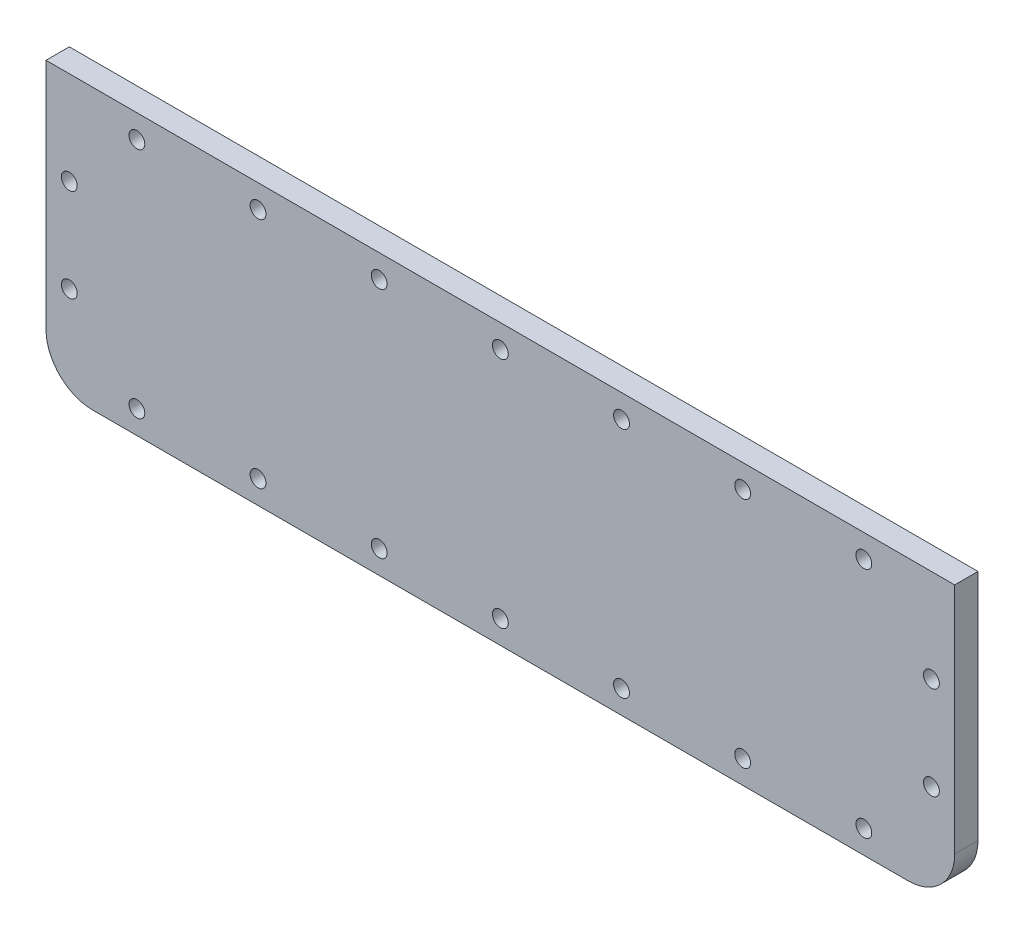
ISO-10303-21;
HEADER;
FILE_DESCRIPTION(('STEP AP214'),'2;1');
FILE_NAME('part.step','',(''),(''),'','','');
FILE_SCHEMA(('AUTOMOTIVE_DESIGN { 1 0 10303 214 1 1 1 1 }'));
ENDSEC;
DATA;
#1=APPLICATION_CONTEXT('core data for automotive mechanical design processes');
#2=APPLICATION_PROTOCOL_DEFINITION('international standard','automotive_design',2000,#1);
#3=PRODUCT_CONTEXT('',#1,'mechanical');
#4=PRODUCT('Part','Part','',(#3));
#5=PRODUCT_RELATED_PRODUCT_CATEGORY('part','',(#4));
#6=PRODUCT_DEFINITION_FORMATION('','',#4);
#7=PRODUCT_DEFINITION_CONTEXT('part definition',#1,'design');
#8=PRODUCT_DEFINITION('design','',#6,#7);
#9=PRODUCT_DEFINITION_SHAPE('','',#8);
#10=(LENGTH_UNIT() NAMED_UNIT(*) SI_UNIT(.MILLI.,.METRE.));
#11=(NAMED_UNIT(*) PLANE_ANGLE_UNIT() SI_UNIT($,.RADIAN.));
#12=(NAMED_UNIT(*) SI_UNIT($,.STERADIAN.) SOLID_ANGLE_UNIT());
#13=UNCERTAINTY_MEASURE_WITH_UNIT(LENGTH_MEASURE(1.E-05),#10,'distance_accuracy_value','');
#14=(GEOMETRIC_REPRESENTATION_CONTEXT(3) GLOBAL_UNCERTAINTY_ASSIGNED_CONTEXT((#13)) GLOBAL_UNIT_ASSIGNED_CONTEXT((#10,
#11,#12)) REPRESENTATION_CONTEXT('',''));
#15=CARTESIAN_POINT('',(0.,0.,0.));
#16=DIRECTION('',(0.,0.,1.));
#17=DIRECTION('',(1.,0.,0.));
#18=AXIS2_PLACEMENT_3D('',#15,#16,#17);
#19=CARTESIAN_POINT('',(0.,0.,6.35));
#20=DIRECTION('',(0.,0.,1.));
#21=DIRECTION('',(1.,0.,0.));
#22=AXIS2_PLACEMENT_3D('',#19,#20,#21);
#23=PLANE('',#22);
#24=CARTESIAN_POINT('',(-66.04,31.75,6.35));
#25=DIRECTION('',(0.,0.,1.));
#26=DIRECTION('',(1.,0.,0.));
#27=AXIS2_PLACEMENT_3D('',#24,#25,#26);
#28=CIRCLE('',#27,2.15899999999999);
#29=CARTESIAN_POINT('',(-63.881,31.75,6.35));
#30=VERTEX_POINT('',#29);
#31=EDGE_CURVE('E239',#30,#30,#28,.T.);
#32=ORIENTED_EDGE('',*,*,#31,.F.);
#33=EDGE_LOOP('',(#32));
#34=FACE_BOUND('',#33,.T.);
#35=CARTESIAN_POINT('',(0.,31.75,6.35));
#36=DIRECTION('',(0.,0.,1.));
#37=DIRECTION('',(1.,0.,0.));
#38=AXIS2_PLACEMENT_3D('',#35,#36,#37);
#39=CIRCLE('',#38,2.159);
#40=CARTESIAN_POINT('',(2.15900000000004,31.75,6.35));
#41=VERTEX_POINT('',#40);
#42=EDGE_CURVE('E227',#41,#41,#39,.T.);
#43=ORIENTED_EDGE('',*,*,#42,.F.);
#44=EDGE_LOOP('',(#43));
#45=FACE_BOUND('',#44,.T.);
#46=CARTESIAN_POINT('',(66.04,31.75,6.35));
#47=DIRECTION('',(0.,0.,1.));
#48=DIRECTION('',(1.,0.,0.));
#49=AXIS2_PLACEMENT_3D('',#46,#47,#48);
#50=CIRCLE('',#49,2.15899999999999);
#51=CARTESIAN_POINT('',(68.199,31.75,6.35));
#52=VERTEX_POINT('',#51);
#53=EDGE_CURVE('E215',#52,#52,#50,.T.);
#54=ORIENTED_EDGE('',*,*,#53,.F.);
#55=EDGE_LOOP('',(#54));
#56=FACE_BOUND('',#55,.T.);
#57=CARTESIAN_POINT('',(117.475,12.7,6.35));
#58=DIRECTION('',(0.,0.,1.));
#59=DIRECTION('',(1.,0.,0.));
#60=AXIS2_PLACEMENT_3D('',#57,#58,#59);
#61=CIRCLE('',#60,2.15900000000002);
#62=CARTESIAN_POINT('',(119.634,12.7,6.35));
#63=VERTEX_POINT('',#62);
#64=EDGE_CURVE('E203',#63,#63,#61,.T.);
#65=ORIENTED_EDGE('',*,*,#64,.F.);
#66=EDGE_LOOP('',(#65));
#67=FACE_BOUND('',#66,.T.);
#68=CARTESIAN_POINT('',(99.06,-31.75,6.35));
#69=DIRECTION('',(0.,0.,1.));
#70=DIRECTION('',(1.,0.,0.));
#71=AXIS2_PLACEMENT_3D('',#68,#69,#70);
#72=CIRCLE('',#71,2.15899999999999);
#73=CARTESIAN_POINT('',(101.219,-31.75,6.35));
#74=VERTEX_POINT('',#73);
#75=EDGE_CURVE('E191',#74,#74,#72,.T.);
#76=ORIENTED_EDGE('',*,*,#75,.F.);
#77=EDGE_LOOP('',(#76));
#78=FACE_BOUND('',#77,.T.);
#79=CARTESIAN_POINT('',(33.02,-31.75,6.35));
#80=DIRECTION('',(0.,0.,1.));
#81=DIRECTION('',(1.,0.,0.));
#82=AXIS2_PLACEMENT_3D('',#79,#80,#81);
#83=CIRCLE('',#82,2.159);
#84=CARTESIAN_POINT('',(35.179,-31.75,6.35));
#85=VERTEX_POINT('',#84);
#86=EDGE_CURVE('E179',#85,#85,#83,.T.);
#87=ORIENTED_EDGE('',*,*,#86,.F.);
#88=EDGE_LOOP('',(#87));
#89=FACE_BOUND('',#88,.T.);
#90=CARTESIAN_POINT('',(-33.02,-31.75,6.35));
#91=DIRECTION('',(0.,0.,1.));
#92=DIRECTION('',(1.,0.,0.));
#93=AXIS2_PLACEMENT_3D('',#90,#91,#92);
#94=CIRCLE('',#93,2.159);
#95=CARTESIAN_POINT('',(-30.861,-31.75,6.35));
#96=VERTEX_POINT('',#95);
#97=EDGE_CURVE('E167',#96,#96,#94,.T.);
#98=ORIENTED_EDGE('',*,*,#97,.F.);
#99=EDGE_LOOP('',(#98));
#100=FACE_BOUND('',#99,.T.);
#101=CARTESIAN_POINT('',(-99.06,-31.75,6.35));
#102=DIRECTION('',(0.,0.,1.));
#103=DIRECTION('',(1.,0.,0.));
#104=AXIS2_PLACEMENT_3D('',#101,#102,#103);
#105=CIRCLE('',#104,2.15899999999999);
#106=CARTESIAN_POINT('',(-96.901,-31.75,6.35));
#107=VERTEX_POINT('',#106);
#108=EDGE_CURVE('E155',#107,#107,#105,.T.);
#109=ORIENTED_EDGE('',*,*,#108,.F.);
#110=EDGE_LOOP('',(#109));
#111=FACE_BOUND('',#110,.T.);
#112=CARTESIAN_POINT('',(-117.475,12.7,6.35));
#113=DIRECTION('',(0.,0.,1.));
#114=DIRECTION('',(1.,0.,0.));
#115=AXIS2_PLACEMENT_3D('',#112,#113,#114);
#116=CIRCLE('',#115,2.15899999999999);
#117=CARTESIAN_POINT('',(-115.316,12.7,6.35));
#118=VERTEX_POINT('',#117);
#119=EDGE_CURVE('E143',#118,#118,#116,.T.);
#120=ORIENTED_EDGE('',*,*,#119,.F.);
#121=EDGE_LOOP('',(#120));
#122=FACE_BOUND('',#121,.T.);
#123=DIRECTION('',(1.,0.,0.));
#124=VECTOR('',#123,1.);
#125=CARTESIAN_POINT('',(-123.825,-38.1,6.35));
#126=LINE('',#125,#124);
#127=CARTESIAN_POINT('',(-111.125,-38.1,6.35));
#128=VERTEX_POINT('',#127);
#129=CARTESIAN_POINT('',(111.125,-38.1,6.35));
#130=VERTEX_POINT('',#129);
#131=EDGE_CURVE('E115',#128,#130,#126,.T.);
#132=ORIENTED_EDGE('',*,*,#131,.T.);
#133=CARTESIAN_POINT('',(111.125,-25.4,6.35));
#134=DIRECTION('',(0.,0.,1.));
#135=DIRECTION('',(1.,0.,0.));
#136=AXIS2_PLACEMENT_3D('',#133,#134,#135);
#137=CIRCLE('',#136,12.7);
#138=CARTESIAN_POINT('',(123.825,-25.4,6.35));
#139=VERTEX_POINT('',#138);
#140=EDGE_CURVE('E41',#130,#139,#137,.T.);
#141=ORIENTED_EDGE('',*,*,#140,.T.);
#142=DIRECTION('',(0.,1.,0.));
#143=VECTOR('',#142,1.);
#144=CARTESIAN_POINT('',(123.825,38.1,6.35));
#145=LINE('',#144,#143);
#146=CARTESIAN_POINT('',(123.825,38.1,6.35));
#147=VERTEX_POINT('',#146);
#148=EDGE_CURVE('E87',#139,#147,#145,.T.);
#149=ORIENTED_EDGE('',*,*,#148,.T.);
#150=DIRECTION('',(-1.,0.,0.));
#151=VECTOR('',#150,1.);
#152=CARTESIAN_POINT('',(-123.825,38.1,6.35));
#153=LINE('',#152,#151);
#154=CARTESIAN_POINT('',(-123.825,38.1,6.35));
#155=VERTEX_POINT('',#154);
#156=EDGE_CURVE('E90',#147,#155,#153,.T.);
#157=ORIENTED_EDGE('',*,*,#156,.T.);
#158=DIRECTION('',(0.,-1.,0.));
#159=VECTOR('',#158,1.);
#160=CARTESIAN_POINT('',(-123.825,38.1,6.35));
#161=LINE('',#160,#159);
#162=CARTESIAN_POINT('',(-123.825,-25.4,6.35));
#163=VERTEX_POINT('',#162);
#164=EDGE_CURVE('E105',#155,#163,#161,.T.);
#165=ORIENTED_EDGE('',*,*,#164,.T.);
#166=CARTESIAN_POINT('',(-111.125,-25.4,6.35));
#167=DIRECTION('',(0.,0.,1.));
#168=DIRECTION('',(1.,0.,0.));
#169=AXIS2_PLACEMENT_3D('',#166,#167,#168);
#170=CIRCLE('',#169,12.7);
#171=EDGE_CURVE('E126',#163,#128,#170,.T.);
#172=ORIENTED_EDGE('',*,*,#171,.T.);
#173=EDGE_LOOP('',(#132,#141,#149,#157,#165,#172));
#174=FACE_BOUND('',#173,.T.);
#175=CARTESIAN_POINT('',(-117.475,-12.7,6.35));
#176=DIRECTION('',(0.,0.,1.));
#177=DIRECTION('',(1.,0.,0.));
#178=AXIS2_PLACEMENT_3D('',#175,#176,#177);
#179=CIRCLE('',#178,2.15899999999999);
#180=CARTESIAN_POINT('',(-115.316,-12.7,6.35));
#181=VERTEX_POINT('',#180);
#182=EDGE_CURVE('E149',#181,#181,#179,.T.);
#183=ORIENTED_EDGE('',*,*,#182,.F.);
#184=EDGE_LOOP('',(#183));
#185=FACE_BOUND('',#184,.T.);
#186=CARTESIAN_POINT('',(-66.04,-31.75,6.35));
#187=DIRECTION('',(0.,0.,1.));
#188=DIRECTION('',(1.,0.,0.));
#189=AXIS2_PLACEMENT_3D('',#186,#187,#188);
#190=CIRCLE('',#189,2.15899999999999);
#191=CARTESIAN_POINT('',(-63.881,-31.75,6.35));
#192=VERTEX_POINT('',#191);
#193=EDGE_CURVE('E161',#192,#192,#190,.T.);
#194=ORIENTED_EDGE('',*,*,#193,.F.);
#195=EDGE_LOOP('',(#194));
#196=FACE_BOUND('',#195,.T.);
#197=CARTESIAN_POINT('',(0.,-31.75,6.35));
#198=DIRECTION('',(0.,0.,1.));
#199=DIRECTION('',(1.,0.,0.));
#200=AXIS2_PLACEMENT_3D('',#197,#198,#199);
#201=CIRCLE('',#200,2.159);
#202=CARTESIAN_POINT('',(2.15900000000003,-31.75,6.35));
#203=VERTEX_POINT('',#202);
#204=EDGE_CURVE('E173',#203,#203,#201,.T.);
#205=ORIENTED_EDGE('',*,*,#204,.F.);
#206=EDGE_LOOP('',(#205));
#207=FACE_BOUND('',#206,.T.);
#208=CARTESIAN_POINT('',(66.04,-31.75,6.35));
#209=DIRECTION('',(0.,0.,1.));
#210=DIRECTION('',(1.,0.,0.));
#211=AXIS2_PLACEMENT_3D('',#208,#209,#210);
#212=CIRCLE('',#211,2.15899999999999);
#213=CARTESIAN_POINT('',(68.199,-31.75,6.35));
#214=VERTEX_POINT('',#213);
#215=EDGE_CURVE('E185',#214,#214,#212,.T.);
#216=ORIENTED_EDGE('',*,*,#215,.F.);
#217=EDGE_LOOP('',(#216));
#218=FACE_BOUND('',#217,.T.);
#219=CARTESIAN_POINT('',(117.475,-12.7,6.35));
#220=DIRECTION('',(0.,0.,1.));
#221=DIRECTION('',(1.,0.,0.));
#222=AXIS2_PLACEMENT_3D('',#219,#220,#221);
#223=CIRCLE('',#222,2.15899999999999);
#224=CARTESIAN_POINT('',(119.634,-12.7,6.35));
#225=VERTEX_POINT('',#224);
#226=EDGE_CURVE('E197',#225,#225,#223,.T.);
#227=ORIENTED_EDGE('',*,*,#226,.F.);
#228=EDGE_LOOP('',(#227));
#229=FACE_BOUND('',#228,.T.);
#230=CARTESIAN_POINT('',(99.06,31.75,6.35));
#231=DIRECTION('',(0.,0.,1.));
#232=DIRECTION('',(1.,0.,0.));
#233=AXIS2_PLACEMENT_3D('',#230,#231,#232);
#234=CIRCLE('',#233,2.15899999999999);
#235=CARTESIAN_POINT('',(101.219,31.75,6.35));
#236=VERTEX_POINT('',#235);
#237=EDGE_CURVE('E209',#236,#236,#234,.T.);
#238=ORIENTED_EDGE('',*,*,#237,.F.);
#239=EDGE_LOOP('',(#238));
#240=FACE_BOUND('',#239,.T.);
#241=CARTESIAN_POINT('',(33.02,31.75,6.35));
#242=DIRECTION('',(0.,0.,1.));
#243=DIRECTION('',(1.,0.,0.));
#244=AXIS2_PLACEMENT_3D('',#241,#242,#243);
#245=CIRCLE('',#244,2.159);
#246=CARTESIAN_POINT('',(35.179,31.75,6.35));
#247=VERTEX_POINT('',#246);
#248=EDGE_CURVE('E221',#247,#247,#245,.T.);
#249=ORIENTED_EDGE('',*,*,#248,.F.);
#250=EDGE_LOOP('',(#249));
#251=FACE_BOUND('',#250,.T.);
#252=CARTESIAN_POINT('',(-33.02,31.75,6.35));
#253=DIRECTION('',(0.,0.,1.));
#254=DIRECTION('',(1.,0.,0.));
#255=AXIS2_PLACEMENT_3D('',#252,#253,#254);
#256=CIRCLE('',#255,2.159);
#257=CARTESIAN_POINT('',(-30.861,31.75,6.35));
#258=VERTEX_POINT('',#257);
#259=EDGE_CURVE('E233',#258,#258,#256,.T.);
#260=ORIENTED_EDGE('',*,*,#259,.F.);
#261=EDGE_LOOP('',(#260));
#262=FACE_BOUND('',#261,.T.);
#263=CARTESIAN_POINT('',(-99.06,31.75,6.35));
#264=DIRECTION('',(0.,0.,1.));
#265=DIRECTION('',(1.,0.,0.));
#266=AXIS2_PLACEMENT_3D('',#263,#264,#265);
#267=CIRCLE('',#266,2.15899999999999);
#268=CARTESIAN_POINT('',(-96.901,31.75,6.35));
#269=VERTEX_POINT('',#268);
#270=EDGE_CURVE('E245',#269,#269,#267,.T.);
#271=ORIENTED_EDGE('',*,*,#270,.F.);
#272=EDGE_LOOP('',(#271));
#273=FACE_BOUND('',#272,.T.);
#274=ADVANCED_FACE('F33',(#34,#45,#56,#67,#78,#89,#100,#111,#122,#174,#185,#196,#207,#218,#229,
#240,#251,#262,#273),#23,.T.);
#275=CARTESIAN_POINT('',(0.,0.,0.));
#276=DIRECTION('',(0.,0.,1.));
#277=DIRECTION('',(1.,0.,0.));
#278=AXIS2_PLACEMENT_3D('',#275,#276,#277);
#279=PLANE('',#278);
#280=DIRECTION('',(0.,1.,0.));
#281=VECTOR('',#280,1.);
#282=CARTESIAN_POINT('',(123.825,38.1,0.));
#283=LINE('',#282,#281);
#284=CARTESIAN_POINT('',(123.825,-25.4,0.));
#285=VERTEX_POINT('',#284);
#286=CARTESIAN_POINT('',(123.825,38.1,0.));
#287=VERTEX_POINT('',#286);
#288=EDGE_CURVE('E109',#285,#287,#283,.T.);
#289=ORIENTED_EDGE('',*,*,#288,.F.);
#290=CARTESIAN_POINT('',(111.125,-25.4,0.));
#291=DIRECTION('',(0.,0.,1.));
#292=DIRECTION('',(1.,0.,0.));
#293=AXIS2_PLACEMENT_3D('',#290,#291,#292);
#294=CIRCLE('',#293,12.7);
#295=CARTESIAN_POINT('',(111.125,-38.1,0.));
#296=VERTEX_POINT('',#295);
#297=EDGE_CURVE('E120',#285,#296,#294,.F.);
#298=ORIENTED_EDGE('',*,*,#297,.T.);
#299=DIRECTION('',(1.,0.,0.));
#300=VECTOR('',#299,1.);
#301=CARTESIAN_POINT('',(-123.825,-38.1,0.));
#302=LINE('',#301,#300);
#303=CARTESIAN_POINT('',(-111.125,-38.1,0.));
#304=VERTEX_POINT('',#303);
#305=EDGE_CURVE('E97',#304,#296,#302,.T.);
#306=ORIENTED_EDGE('',*,*,#305,.F.);
#307=CARTESIAN_POINT('',(-111.125,-25.4,0.));
#308=DIRECTION('',(0.,0.,1.));
#309=DIRECTION('',(1.,0.,0.));
#310=AXIS2_PLACEMENT_3D('',#307,#308,#309);
#311=CIRCLE('',#310,12.7);
#312=CARTESIAN_POINT('',(-123.825,-25.4,0.));
#313=VERTEX_POINT('',#312);
#314=EDGE_CURVE('E113',#304,#313,#311,.F.);
#315=ORIENTED_EDGE('',*,*,#314,.T.);
#316=DIRECTION('',(0.,-1.,0.));
#317=VECTOR('',#316,1.);
#318=CARTESIAN_POINT('',(-123.825,38.1,0.));
#319=LINE('',#318,#317);
#320=CARTESIAN_POINT('',(-123.825,38.1,0.));
#321=VERTEX_POINT('',#320);
#322=EDGE_CURVE('E137',#321,#313,#319,.T.);
#323=ORIENTED_EDGE('',*,*,#322,.F.);
#324=DIRECTION('',(-1.,0.,0.));
#325=VECTOR('',#324,1.);
#326=CARTESIAN_POINT('',(-123.825,38.1,0.));
#327=LINE('',#326,#325);
#328=EDGE_CURVE('E139',#287,#321,#327,.T.);
#329=ORIENTED_EDGE('',*,*,#328,.F.);
#330=EDGE_LOOP('',(#289,#298,#306,#315,#323,#329));
#331=FACE_BOUND('',#330,.T.);
#332=CARTESIAN_POINT('',(-117.475,12.7,0.));
#333=DIRECTION('',(0.,0.,1.));
#334=DIRECTION('',(1.,0.,0.));
#335=AXIS2_PLACEMENT_3D('',#332,#333,#334);
#336=CIRCLE('',#335,2.15899999999999);
#337=CARTESIAN_POINT('',(-115.316,12.7,0.));
#338=VERTEX_POINT('',#337);
#339=EDGE_CURVE('E146',#338,#338,#336,.T.);
#340=ORIENTED_EDGE('',*,*,#339,.T.);
#341=EDGE_LOOP('',(#340));
#342=FACE_BOUND('',#341,.T.);
#343=CARTESIAN_POINT('',(-117.475,-12.7,0.));
#344=DIRECTION('',(0.,0.,1.));
#345=DIRECTION('',(1.,0.,0.));
#346=AXIS2_PLACEMENT_3D('',#343,#344,#345);
#347=CIRCLE('',#346,2.15899999999999);
#348=CARTESIAN_POINT('',(-115.316,-12.7,0.));
#349=VERTEX_POINT('',#348);
#350=EDGE_CURVE('E152',#349,#349,#347,.T.);
#351=ORIENTED_EDGE('',*,*,#350,.T.);
#352=EDGE_LOOP('',(#351));
#353=FACE_BOUND('',#352,.T.);
#354=CARTESIAN_POINT('',(-99.06,-31.75,0.));
#355=DIRECTION('',(0.,0.,1.));
#356=DIRECTION('',(1.,0.,0.));
#357=AXIS2_PLACEMENT_3D('',#354,#355,#356);
#358=CIRCLE('',#357,2.15899999999999);
#359=CARTESIAN_POINT('',(-96.901,-31.75,0.));
#360=VERTEX_POINT('',#359);
#361=EDGE_CURVE('E158',#360,#360,#358,.T.);
#362=ORIENTED_EDGE('',*,*,#361,.T.);
#363=EDGE_LOOP('',(#362));
#364=FACE_BOUND('',#363,.T.);
#365=CARTESIAN_POINT('',(-66.04,-31.75,0.));
#366=DIRECTION('',(0.,0.,1.));
#367=DIRECTION('',(1.,0.,0.));
#368=AXIS2_PLACEMENT_3D('',#365,#366,#367);
#369=CIRCLE('',#368,2.15899999999999);
#370=CARTESIAN_POINT('',(-63.881,-31.75,0.));
#371=VERTEX_POINT('',#370);
#372=EDGE_CURVE('E164',#371,#371,#369,.T.);
#373=ORIENTED_EDGE('',*,*,#372,.T.);
#374=EDGE_LOOP('',(#373));
#375=FACE_BOUND('',#374,.T.);
#376=CARTESIAN_POINT('',(-33.02,-31.75,0.));
#377=DIRECTION('',(0.,0.,1.));
#378=DIRECTION('',(1.,0.,0.));
#379=AXIS2_PLACEMENT_3D('',#376,#377,#378);
#380=CIRCLE('',#379,2.159);
#381=CARTESIAN_POINT('',(-30.861,-31.75,0.));
#382=VERTEX_POINT('',#381);
#383=EDGE_CURVE('E170',#382,#382,#380,.T.);
#384=ORIENTED_EDGE('',*,*,#383,.T.);
#385=EDGE_LOOP('',(#384));
#386=FACE_BOUND('',#385,.T.);
#387=CARTESIAN_POINT('',(0.,-31.75,0.));
#388=DIRECTION('',(0.,0.,1.));
#389=DIRECTION('',(1.,0.,0.));
#390=AXIS2_PLACEMENT_3D('',#387,#388,#389);
#391=CIRCLE('',#390,2.159);
#392=CARTESIAN_POINT('',(2.15900000000003,-31.75,0.));
#393=VERTEX_POINT('',#392);
#394=EDGE_CURVE('E176',#393,#393,#391,.T.);
#395=ORIENTED_EDGE('',*,*,#394,.T.);
#396=EDGE_LOOP('',(#395));
#397=FACE_BOUND('',#396,.T.);
#398=CARTESIAN_POINT('',(33.02,-31.75,0.));
#399=DIRECTION('',(0.,0.,1.));
#400=DIRECTION('',(1.,0.,0.));
#401=AXIS2_PLACEMENT_3D('',#398,#399,#400);
#402=CIRCLE('',#401,2.159);
#403=CARTESIAN_POINT('',(35.179,-31.75,0.));
#404=VERTEX_POINT('',#403);
#405=EDGE_CURVE('E182',#404,#404,#402,.T.);
#406=ORIENTED_EDGE('',*,*,#405,.T.);
#407=EDGE_LOOP('',(#406));
#408=FACE_BOUND('',#407,.T.);
#409=CARTESIAN_POINT('',(66.04,-31.75,0.));
#410=DIRECTION('',(0.,0.,1.));
#411=DIRECTION('',(1.,0.,0.));
#412=AXIS2_PLACEMENT_3D('',#409,#410,#411);
#413=CIRCLE('',#412,2.15899999999999);
#414=CARTESIAN_POINT('',(68.199,-31.75,0.));
#415=VERTEX_POINT('',#414);
#416=EDGE_CURVE('E188',#415,#415,#413,.T.);
#417=ORIENTED_EDGE('',*,*,#416,.T.);
#418=EDGE_LOOP('',(#417));
#419=FACE_BOUND('',#418,.T.);
#420=CARTESIAN_POINT('',(99.06,-31.75,0.));
#421=DIRECTION('',(0.,0.,1.));
#422=DIRECTION('',(1.,0.,0.));
#423=AXIS2_PLACEMENT_3D('',#420,#421,#422);
#424=CIRCLE('',#423,2.15899999999999);
#425=CARTESIAN_POINT('',(101.219,-31.75,0.));
#426=VERTEX_POINT('',#425);
#427=EDGE_CURVE('E194',#426,#426,#424,.T.);
#428=ORIENTED_EDGE('',*,*,#427,.T.);
#429=EDGE_LOOP('',(#428));
#430=FACE_BOUND('',#429,.T.);
#431=CARTESIAN_POINT('',(117.475,-12.7,0.));
#432=DIRECTION('',(0.,0.,1.));
#433=DIRECTION('',(1.,0.,0.));
#434=AXIS2_PLACEMENT_3D('',#431,#432,#433);
#435=CIRCLE('',#434,2.15899999999999);
#436=CARTESIAN_POINT('',(119.634,-12.7,0.));
#437=VERTEX_POINT('',#436);
#438=EDGE_CURVE('E200',#437,#437,#435,.T.);
#439=ORIENTED_EDGE('',*,*,#438,.T.);
#440=EDGE_LOOP('',(#439));
#441=FACE_BOUND('',#440,.T.);
#442=CARTESIAN_POINT('',(117.475,12.7,0.));
#443=DIRECTION('',(0.,0.,1.));
#444=DIRECTION('',(1.,0.,0.));
#445=AXIS2_PLACEMENT_3D('',#442,#443,#444);
#446=CIRCLE('',#445,2.15900000000002);
#447=CARTESIAN_POINT('',(119.634,12.7,0.));
#448=VERTEX_POINT('',#447);
#449=EDGE_CURVE('E206',#448,#448,#446,.T.);
#450=ORIENTED_EDGE('',*,*,#449,.T.);
#451=EDGE_LOOP('',(#450));
#452=FACE_BOUND('',#451,.T.);
#453=CARTESIAN_POINT('',(99.06,31.75,0.));
#454=DIRECTION('',(0.,0.,1.));
#455=DIRECTION('',(1.,0.,0.));
#456=AXIS2_PLACEMENT_3D('',#453,#454,#455);
#457=CIRCLE('',#456,2.15899999999999);
#458=CARTESIAN_POINT('',(101.219,31.75,0.));
#459=VERTEX_POINT('',#458);
#460=EDGE_CURVE('E212',#459,#459,#457,.T.);
#461=ORIENTED_EDGE('',*,*,#460,.T.);
#462=EDGE_LOOP('',(#461));
#463=FACE_BOUND('',#462,.T.);
#464=CARTESIAN_POINT('',(66.04,31.75,0.));
#465=DIRECTION('',(0.,0.,1.));
#466=DIRECTION('',(1.,0.,0.));
#467=AXIS2_PLACEMENT_3D('',#464,#465,#466);
#468=CIRCLE('',#467,2.15899999999999);
#469=CARTESIAN_POINT('',(68.199,31.75,0.));
#470=VERTEX_POINT('',#469);
#471=EDGE_CURVE('E218',#470,#470,#468,.T.);
#472=ORIENTED_EDGE('',*,*,#471,.T.);
#473=EDGE_LOOP('',(#472));
#474=FACE_BOUND('',#473,.T.);
#475=CARTESIAN_POINT('',(33.02,31.75,0.));
#476=DIRECTION('',(0.,0.,1.));
#477=DIRECTION('',(1.,0.,0.));
#478=AXIS2_PLACEMENT_3D('',#475,#476,#477);
#479=CIRCLE('',#478,2.159);
#480=CARTESIAN_POINT('',(35.179,31.75,0.));
#481=VERTEX_POINT('',#480);
#482=EDGE_CURVE('E224',#481,#481,#479,.T.);
#483=ORIENTED_EDGE('',*,*,#482,.T.);
#484=EDGE_LOOP('',(#483));
#485=FACE_BOUND('',#484,.T.);
#486=CARTESIAN_POINT('',(0.,31.75,0.));
#487=DIRECTION('',(0.,0.,1.));
#488=DIRECTION('',(1.,0.,0.));
#489=AXIS2_PLACEMENT_3D('',#486,#487,#488);
#490=CIRCLE('',#489,2.159);
#491=CARTESIAN_POINT('',(2.15900000000004,31.75,0.));
#492=VERTEX_POINT('',#491);
#493=EDGE_CURVE('E230',#492,#492,#490,.T.);
#494=ORIENTED_EDGE('',*,*,#493,.T.);
#495=EDGE_LOOP('',(#494));
#496=FACE_BOUND('',#495,.T.);
#497=CARTESIAN_POINT('',(-33.02,31.75,0.));
#498=DIRECTION('',(0.,0.,1.));
#499=DIRECTION('',(1.,0.,0.));
#500=AXIS2_PLACEMENT_3D('',#497,#498,#499);
#501=CIRCLE('',#500,2.159);
#502=CARTESIAN_POINT('',(-30.861,31.75,0.));
#503=VERTEX_POINT('',#502);
#504=EDGE_CURVE('E236',#503,#503,#501,.T.);
#505=ORIENTED_EDGE('',*,*,#504,.T.);
#506=EDGE_LOOP('',(#505));
#507=FACE_BOUND('',#506,.T.);
#508=CARTESIAN_POINT('',(-66.04,31.75,0.));
#509=DIRECTION('',(0.,0.,1.));
#510=DIRECTION('',(1.,0.,0.));
#511=AXIS2_PLACEMENT_3D('',#508,#509,#510);
#512=CIRCLE('',#511,2.15899999999999);
#513=CARTESIAN_POINT('',(-63.881,31.75,0.));
#514=VERTEX_POINT('',#513);
#515=EDGE_CURVE('E242',#514,#514,#512,.T.);
#516=ORIENTED_EDGE('',*,*,#515,.T.);
#517=EDGE_LOOP('',(#516));
#518=FACE_BOUND('',#517,.T.);
#519=CARTESIAN_POINT('',(-99.06,31.75,0.));
#520=DIRECTION('',(0.,0.,1.));
#521=DIRECTION('',(1.,0.,0.));
#522=AXIS2_PLACEMENT_3D('',#519,#520,#521);
#523=CIRCLE('',#522,2.15899999999999);
#524=CARTESIAN_POINT('',(-96.901,31.75,0.));
#525=VERTEX_POINT('',#524);
#526=EDGE_CURVE('E248',#525,#525,#523,.T.);
#527=ORIENTED_EDGE('',*,*,#526,.T.);
#528=EDGE_LOOP('',(#527));
#529=FACE_BOUND('',#528,.T.);
#530=ADVANCED_FACE('F135',(#331,#342,#353,#364,#375,#386,#397,#408,#419,#430,#441,#452,#463,
#474,#485,#496,#507,#518,#529),#279,.F.);
#531=CARTESIAN_POINT('',(123.825,38.1,6.35));
#532=DIRECTION('',(-1.,0.,0.));
#533=DIRECTION('',(0.,-1.,0.));
#534=AXIS2_PLACEMENT_3D('',#531,#532,#533);
#535=PLANE('',#534);
#536=ORIENTED_EDGE('',*,*,#148,.F.);
#537=DIRECTION('',(0.,0.,-1.));
#538=VECTOR('',#537,1.);
#539=CARTESIAN_POINT('',(123.825,-25.4,6.35));
#540=LINE('',#539,#538);
#541=EDGE_CURVE('E111',#139,#285,#540,.T.);
#542=ORIENTED_EDGE('',*,*,#541,.T.);
#543=ORIENTED_EDGE('',*,*,#288,.T.);
#544=DIRECTION('',(0.,0.,-1.));
#545=VECTOR('',#544,1.);
#546=CARTESIAN_POINT('',(123.825,38.1,6.35));
#547=LINE('',#546,#545);
#548=EDGE_CURVE('E102',#147,#287,#547,.T.);
#549=ORIENTED_EDGE('',*,*,#548,.F.);
#550=EDGE_LOOP('',(#536,#542,#543,#549));
#551=FACE_BOUND('',#550,.T.);
#552=ADVANCED_FACE('F107',(#551),#535,.F.);
#553=CARTESIAN_POINT('',(-123.825,38.1,6.35));
#554=DIRECTION('',(0.,-1.,0.));
#555=DIRECTION('',(0.,0.,-1.));
#556=AXIS2_PLACEMENT_3D('',#553,#554,#555);
#557=PLANE('',#556);
#558=ORIENTED_EDGE('',*,*,#328,.T.);
#559=DIRECTION('',(0.,0.,-1.));
#560=VECTOR('',#559,1.);
#561=CARTESIAN_POINT('',(-123.825,38.1,6.35));
#562=LINE('',#561,#560);
#563=EDGE_CURVE('E104',#155,#321,#562,.T.);
#564=ORIENTED_EDGE('',*,*,#563,.F.);
#565=ORIENTED_EDGE('',*,*,#156,.F.);
#566=ORIENTED_EDGE('',*,*,#548,.T.);
#567=EDGE_LOOP('',(#558,#564,#565,#566));
#568=FACE_BOUND('',#567,.T.);
#569=ADVANCED_FACE('F101',(#568),#557,.F.);
#570=CARTESIAN_POINT('',(-123.825,38.1,6.35));
#571=DIRECTION('',(1.,0.,0.));
#572=DIRECTION('',(0.,0.,-1.));
#573=AXIS2_PLACEMENT_3D('',#570,#571,#572);
#574=PLANE('',#573);
#575=ORIENTED_EDGE('',*,*,#322,.T.);
#576=DIRECTION('',(0.,0.,-1.));
#577=VECTOR('',#576,1.);
#578=CARTESIAN_POINT('',(-123.825,-25.4,6.35));
#579=LINE('',#578,#577);
#580=EDGE_CURVE('E11',#313,#163,#579,.F.);
#581=ORIENTED_EDGE('',*,*,#580,.T.);
#582=ORIENTED_EDGE('',*,*,#164,.F.);
#583=ORIENTED_EDGE('',*,*,#563,.T.);
#584=EDGE_LOOP('',(#575,#581,#582,#583));
#585=FACE_BOUND('',#584,.T.);
#586=ADVANCED_FACE('F138',(#585),#574,.F.);
#587=CARTESIAN_POINT('',(-123.825,-38.1,6.35));
#588=DIRECTION('',(0.,1.,0.));
#589=DIRECTION('',(0.,0.,1.));
#590=AXIS2_PLACEMENT_3D('',#587,#588,#589);
#591=PLANE('',#590);
#592=ORIENTED_EDGE('',*,*,#305,.T.);
#593=DIRECTION('',(0.,0.,-1.));
#594=VECTOR('',#593,1.);
#595=CARTESIAN_POINT('',(111.125,-38.1,6.35));
#596=LINE('',#595,#594);
#597=EDGE_CURVE('E54',#296,#130,#596,.F.);
#598=ORIENTED_EDGE('',*,*,#597,.T.);
#599=ORIENTED_EDGE('',*,*,#131,.F.);
#600=DIRECTION('',(0.,0.,-1.));
#601=VECTOR('',#600,1.);
#602=CARTESIAN_POINT('',(-111.125,-38.1,6.35));
#603=LINE('',#602,#601);
#604=EDGE_CURVE('E122',#128,#304,#603,.T.);
#605=ORIENTED_EDGE('',*,*,#604,.T.);
#606=EDGE_LOOP('',(#592,#598,#599,#605));
#607=FACE_BOUND('',#606,.T.);
#608=ADVANCED_FACE('F130',(#607),#591,.F.);
#609=CARTESIAN_POINT('',(-117.475,12.7,6.35));
#610=DIRECTION('',(0.,0.,-1.));
#611=DIRECTION('',(-1.,0.,0.));
#612=AXIS2_PLACEMENT_3D('',#609,#610,#611);
#613=CYLINDRICAL_SURFACE('',#612,2.15899999999999);
#614=ORIENTED_EDGE('',*,*,#119,.T.);
#615=EDGE_LOOP('',(#614));
#616=FACE_BOUND('',#615,.T.);
#617=ORIENTED_EDGE('',*,*,#339,.F.);
#618=EDGE_LOOP('',(#617));
#619=FACE_BOUND('',#618,.T.);
#620=ADVANCED_FACE('F267',(#616,#619),#613,.F.);
#621=CARTESIAN_POINT('',(-117.475,-12.7,6.35));
#622=DIRECTION('',(0.,0.,-1.));
#623=DIRECTION('',(-1.,0.,0.));
#624=AXIS2_PLACEMENT_3D('',#621,#622,#623);
#625=CYLINDRICAL_SURFACE('',#624,2.15899999999999);
#626=ORIENTED_EDGE('',*,*,#182,.T.);
#627=EDGE_LOOP('',(#626));
#628=FACE_BOUND('',#627,.T.);
#629=ORIENTED_EDGE('',*,*,#350,.F.);
#630=EDGE_LOOP('',(#629));
#631=FACE_BOUND('',#630,.T.);
#632=ADVANCED_FACE('F346',(#628,#631),#625,.F.);
#633=CARTESIAN_POINT('',(-99.06,-31.75,6.35));
#634=DIRECTION('',(0.,0.,-1.));
#635=DIRECTION('',(-1.,0.,0.));
#636=AXIS2_PLACEMENT_3D('',#633,#634,#635);
#637=CYLINDRICAL_SURFACE('',#636,2.15899999999999);
#638=ORIENTED_EDGE('',*,*,#108,.T.);
#639=EDGE_LOOP('',(#638));
#640=FACE_BOUND('',#639,.T.);
#641=ORIENTED_EDGE('',*,*,#361,.F.);
#642=EDGE_LOOP('',(#641));
#643=FACE_BOUND('',#642,.T.);
#644=ADVANCED_FACE('F343',(#640,#643),#637,.F.);
#645=CARTESIAN_POINT('',(-66.04,-31.75,6.35));
#646=DIRECTION('',(0.,0.,-1.));
#647=DIRECTION('',(-1.,0.,0.));
#648=AXIS2_PLACEMENT_3D('',#645,#646,#647);
#649=CYLINDRICAL_SURFACE('',#648,2.15899999999999);
#650=ORIENTED_EDGE('',*,*,#193,.T.);
#651=EDGE_LOOP('',(#650));
#652=FACE_BOUND('',#651,.T.);
#653=ORIENTED_EDGE('',*,*,#372,.F.);
#654=EDGE_LOOP('',(#653));
#655=FACE_BOUND('',#654,.T.);
#656=ADVANCED_FACE('F339',(#652,#655),#649,.F.);
#657=CARTESIAN_POINT('',(-33.02,-31.75,6.35));
#658=DIRECTION('',(0.,0.,-1.));
#659=DIRECTION('',(-1.,0.,0.));
#660=AXIS2_PLACEMENT_3D('',#657,#658,#659);
#661=CYLINDRICAL_SURFACE('',#660,2.159);
#662=ORIENTED_EDGE('',*,*,#97,.T.);
#663=EDGE_LOOP('',(#662));
#664=FACE_BOUND('',#663,.T.);
#665=ORIENTED_EDGE('',*,*,#383,.F.);
#666=EDGE_LOOP('',(#665));
#667=FACE_BOUND('',#666,.T.);
#668=ADVANCED_FACE('F335',(#664,#667),#661,.F.);
#669=CARTESIAN_POINT('',(0.,-31.75,6.35));
#670=DIRECTION('',(0.,0.,-1.));
#671=DIRECTION('',(-1.,0.,0.));
#672=AXIS2_PLACEMENT_3D('',#669,#670,#671);
#673=CYLINDRICAL_SURFACE('',#672,2.159);
#674=ORIENTED_EDGE('',*,*,#204,.T.);
#675=EDGE_LOOP('',(#674));
#676=FACE_BOUND('',#675,.T.);
#677=ORIENTED_EDGE('',*,*,#394,.F.);
#678=EDGE_LOOP('',(#677));
#679=FACE_BOUND('',#678,.T.);
#680=ADVANCED_FACE('F331',(#676,#679),#673,.F.);
#681=CARTESIAN_POINT('',(33.02,-31.75,6.35));
#682=DIRECTION('',(0.,0.,-1.));
#683=DIRECTION('',(-1.,0.,0.));
#684=AXIS2_PLACEMENT_3D('',#681,#682,#683);
#685=CYLINDRICAL_SURFACE('',#684,2.159);
#686=ORIENTED_EDGE('',*,*,#86,.T.);
#687=EDGE_LOOP('',(#686));
#688=FACE_BOUND('',#687,.T.);
#689=ORIENTED_EDGE('',*,*,#405,.F.);
#690=EDGE_LOOP('',(#689));
#691=FACE_BOUND('',#690,.T.);
#692=ADVANCED_FACE('F327',(#688,#691),#685,.F.);
#693=CARTESIAN_POINT('',(66.04,-31.75,6.35));
#694=DIRECTION('',(0.,0.,-1.));
#695=DIRECTION('',(-1.,0.,0.));
#696=AXIS2_PLACEMENT_3D('',#693,#694,#695);
#697=CYLINDRICAL_SURFACE('',#696,2.15899999999999);
#698=ORIENTED_EDGE('',*,*,#215,.T.);
#699=EDGE_LOOP('',(#698));
#700=FACE_BOUND('',#699,.T.);
#701=ORIENTED_EDGE('',*,*,#416,.F.);
#702=EDGE_LOOP('',(#701));
#703=FACE_BOUND('',#702,.T.);
#704=ADVANCED_FACE('F323',(#700,#703),#697,.F.);
#705=CARTESIAN_POINT('',(99.06,-31.75,6.35));
#706=DIRECTION('',(0.,0.,-1.));
#707=DIRECTION('',(-1.,0.,0.));
#708=AXIS2_PLACEMENT_3D('',#705,#706,#707);
#709=CYLINDRICAL_SURFACE('',#708,2.15899999999999);
#710=ORIENTED_EDGE('',*,*,#75,.T.);
#711=EDGE_LOOP('',(#710));
#712=FACE_BOUND('',#711,.T.);
#713=ORIENTED_EDGE('',*,*,#427,.F.);
#714=EDGE_LOOP('',(#713));
#715=FACE_BOUND('',#714,.T.);
#716=ADVANCED_FACE('F319',(#712,#715),#709,.F.);
#717=CARTESIAN_POINT('',(117.475,-12.7,6.35));
#718=DIRECTION('',(0.,0.,-1.));
#719=DIRECTION('',(-1.,0.,0.));
#720=AXIS2_PLACEMENT_3D('',#717,#718,#719);
#721=CYLINDRICAL_SURFACE('',#720,2.15899999999999);
#722=ORIENTED_EDGE('',*,*,#226,.T.);
#723=EDGE_LOOP('',(#722));
#724=FACE_BOUND('',#723,.T.);
#725=ORIENTED_EDGE('',*,*,#438,.F.);
#726=EDGE_LOOP('',(#725));
#727=FACE_BOUND('',#726,.T.);
#728=ADVANCED_FACE('F315',(#724,#727),#721,.F.);
#729=CARTESIAN_POINT('',(117.475,12.7,6.35));
#730=DIRECTION('',(0.,0.,-1.));
#731=DIRECTION('',(-1.,0.,0.));
#732=AXIS2_PLACEMENT_3D('',#729,#730,#731);
#733=CYLINDRICAL_SURFACE('',#732,2.15900000000002);
#734=ORIENTED_EDGE('',*,*,#64,.T.);
#735=EDGE_LOOP('',(#734));
#736=FACE_BOUND('',#735,.T.);
#737=ORIENTED_EDGE('',*,*,#449,.F.);
#738=EDGE_LOOP('',(#737));
#739=FACE_BOUND('',#738,.T.);
#740=ADVANCED_FACE('F311',(#736,#739),#733,.F.);
#741=CARTESIAN_POINT('',(99.06,31.75,6.35));
#742=DIRECTION('',(0.,0.,-1.));
#743=DIRECTION('',(-1.,0.,0.));
#744=AXIS2_PLACEMENT_3D('',#741,#742,#743);
#745=CYLINDRICAL_SURFACE('',#744,2.15899999999999);
#746=ORIENTED_EDGE('',*,*,#237,.T.);
#747=EDGE_LOOP('',(#746));
#748=FACE_BOUND('',#747,.T.);
#749=ORIENTED_EDGE('',*,*,#460,.F.);
#750=EDGE_LOOP('',(#749));
#751=FACE_BOUND('',#750,.T.);
#752=ADVANCED_FACE('F307',(#748,#751),#745,.F.);
#753=CARTESIAN_POINT('',(66.04,31.75,6.35));
#754=DIRECTION('',(0.,0.,-1.));
#755=DIRECTION('',(-1.,0.,0.));
#756=AXIS2_PLACEMENT_3D('',#753,#754,#755);
#757=CYLINDRICAL_SURFACE('',#756,2.15899999999999);
#758=ORIENTED_EDGE('',*,*,#53,.T.);
#759=EDGE_LOOP('',(#758));
#760=FACE_BOUND('',#759,.T.);
#761=ORIENTED_EDGE('',*,*,#471,.F.);
#762=EDGE_LOOP('',(#761));
#763=FACE_BOUND('',#762,.T.);
#764=ADVANCED_FACE('F303',(#760,#763),#757,.F.);
#765=CARTESIAN_POINT('',(33.02,31.75,6.35));
#766=DIRECTION('',(0.,0.,-1.));
#767=DIRECTION('',(-1.,0.,0.));
#768=AXIS2_PLACEMENT_3D('',#765,#766,#767);
#769=CYLINDRICAL_SURFACE('',#768,2.159);
#770=ORIENTED_EDGE('',*,*,#248,.T.);
#771=EDGE_LOOP('',(#770));
#772=FACE_BOUND('',#771,.T.);
#773=ORIENTED_EDGE('',*,*,#482,.F.);
#774=EDGE_LOOP('',(#773));
#775=FACE_BOUND('',#774,.T.);
#776=ADVANCED_FACE('F299',(#772,#775),#769,.F.);
#777=CARTESIAN_POINT('',(0.,31.75,6.35));
#778=DIRECTION('',(0.,0.,-1.));
#779=DIRECTION('',(-1.,0.,0.));
#780=AXIS2_PLACEMENT_3D('',#777,#778,#779);
#781=CYLINDRICAL_SURFACE('',#780,2.159);
#782=ORIENTED_EDGE('',*,*,#42,.T.);
#783=EDGE_LOOP('',(#782));
#784=FACE_BOUND('',#783,.T.);
#785=ORIENTED_EDGE('',*,*,#493,.F.);
#786=EDGE_LOOP('',(#785));
#787=FACE_BOUND('',#786,.T.);
#788=ADVANCED_FACE('F295',(#784,#787),#781,.F.);
#789=CARTESIAN_POINT('',(-33.02,31.75,6.35));
#790=DIRECTION('',(0.,0.,-1.));
#791=DIRECTION('',(-1.,0.,0.));
#792=AXIS2_PLACEMENT_3D('',#789,#790,#791);
#793=CYLINDRICAL_SURFACE('',#792,2.159);
#794=ORIENTED_EDGE('',*,*,#259,.T.);
#795=EDGE_LOOP('',(#794));
#796=FACE_BOUND('',#795,.T.);
#797=ORIENTED_EDGE('',*,*,#504,.F.);
#798=EDGE_LOOP('',(#797));
#799=FACE_BOUND('',#798,.T.);
#800=ADVANCED_FACE('F289',(#796,#799),#793,.F.);
#801=CARTESIAN_POINT('',(-66.04,31.75,6.35));
#802=DIRECTION('',(0.,0.,-1.));
#803=DIRECTION('',(-1.,0.,0.));
#804=AXIS2_PLACEMENT_3D('',#801,#802,#803);
#805=CYLINDRICAL_SURFACE('',#804,2.15899999999999);
#806=ORIENTED_EDGE('',*,*,#31,.T.);
#807=EDGE_LOOP('',(#806));
#808=FACE_BOUND('',#807,.T.);
#809=ORIENTED_EDGE('',*,*,#515,.F.);
#810=EDGE_LOOP('',(#809));
#811=FACE_BOUND('',#810,.T.);
#812=ADVANCED_FACE('F284',(#808,#811),#805,.F.);
#813=CARTESIAN_POINT('',(-99.06,31.75,6.35));
#814=DIRECTION('',(0.,0.,-1.));
#815=DIRECTION('',(-1.,0.,0.));
#816=AXIS2_PLACEMENT_3D('',#813,#814,#815);
#817=CYLINDRICAL_SURFACE('',#816,2.15899999999999);
#818=ORIENTED_EDGE('',*,*,#270,.T.);
#819=EDGE_LOOP('',(#818));
#820=FACE_BOUND('',#819,.T.);
#821=ORIENTED_EDGE('',*,*,#526,.F.);
#822=EDGE_LOOP('',(#821));
#823=FACE_BOUND('',#822,.T.);
#824=ADVANCED_FACE('F254',(#820,#823),#817,.F.);
#825=CARTESIAN_POINT('',(111.125,-25.4,6.35));
#826=DIRECTION('',(0.,0.,-1.));
#827=DIRECTION('',(-1.,0.,0.));
#828=AXIS2_PLACEMENT_3D('',#825,#826,#827);
#829=CYLINDRICAL_SURFACE('',#828,12.7);
#830=ORIENTED_EDGE('',*,*,#140,.F.);
#831=ORIENTED_EDGE('',*,*,#597,.F.);
#832=ORIENTED_EDGE('',*,*,#297,.F.);
#833=ORIENTED_EDGE('',*,*,#541,.F.);
#834=EDGE_LOOP('',(#830,#831,#832,#833));
#835=FACE_BOUND('',#834,.T.);
#836=ADVANCED_FACE('F277',(#835),#829,.T.);
#837=CARTESIAN_POINT('',(-111.125,-25.4,6.35));
#838=DIRECTION('',(0.,0.,-1.));
#839=DIRECTION('',(-1.,0.,0.));
#840=AXIS2_PLACEMENT_3D('',#837,#838,#839);
#841=CYLINDRICAL_SURFACE('',#840,12.7);
#842=ORIENTED_EDGE('',*,*,#171,.F.);
#843=ORIENTED_EDGE('',*,*,#580,.F.);
#844=ORIENTED_EDGE('',*,*,#314,.F.);
#845=ORIENTED_EDGE('',*,*,#604,.F.);
#846=EDGE_LOOP('',(#842,#843,#844,#845));
#847=FACE_BOUND('',#846,.T.);
#848=ADVANCED_FACE('F35',(#847),#841,.T.);
#849=CLOSED_SHELL('',(#274,#530,#552,#569,#586,#608,#620,#632,#644,#656,#668,#680,#692,#704,
#716,#728,#740,#752,#764,#776,#788,#800,#812,#824,#836,#848));
#850=MANIFOLD_SOLID_BREP('B2',#849);
#851=ADVANCED_BREP_SHAPE_REPRESENTATION('',(#18,#850),#14);
#852=SHAPE_DEFINITION_REPRESENTATION(#9,#851);
ENDSEC;
END-ISO-10303-21;
